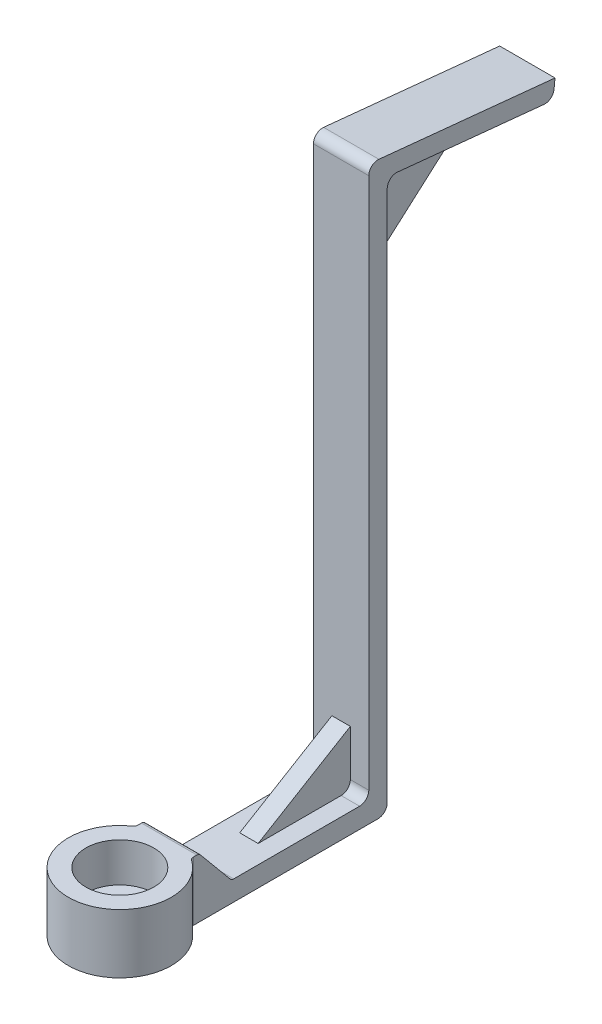
ISO-10303-21;
HEADER;
FILE_DESCRIPTION(('STEP AP214'),'2;1');
FILE_NAME('part.step','',(''),(''),'','','');
FILE_SCHEMA(('AUTOMOTIVE_DESIGN { 1 0 10303 214 1 1 1 1 }'));
ENDSEC;
DATA;
#1=APPLICATION_CONTEXT('core data for automotive mechanical design processes');
#2=APPLICATION_PROTOCOL_DEFINITION('international standard','automotive_design',2000,#1);
#3=PRODUCT_CONTEXT('',#1,'mechanical');
#4=PRODUCT('Part','Part','',(#3));
#5=PRODUCT_RELATED_PRODUCT_CATEGORY('part','',(#4));
#6=PRODUCT_DEFINITION_FORMATION('','',#4);
#7=PRODUCT_DEFINITION_CONTEXT('part definition',#1,'design');
#8=PRODUCT_DEFINITION('design','',#6,#7);
#9=PRODUCT_DEFINITION_SHAPE('','',#8);
#10=(LENGTH_UNIT() NAMED_UNIT(*) SI_UNIT(.MILLI.,.METRE.));
#11=(NAMED_UNIT(*) PLANE_ANGLE_UNIT() SI_UNIT($,.RADIAN.));
#12=(NAMED_UNIT(*) SI_UNIT($,.STERADIAN.) SOLID_ANGLE_UNIT());
#13=UNCERTAINTY_MEASURE_WITH_UNIT(LENGTH_MEASURE(1.E-05),#10,'distance_accuracy_value','');
#14=(GEOMETRIC_REPRESENTATION_CONTEXT(3) GLOBAL_UNCERTAINTY_ASSIGNED_CONTEXT((#13)) GLOBAL_UNIT_ASSIGNED_CONTEXT((#10,
#11,#12)) REPRESENTATION_CONTEXT('',''));
#15=CARTESIAN_POINT('',(0.,0.,0.));
#16=DIRECTION('',(0.,0.,1.));
#17=DIRECTION('',(1.,0.,0.));
#18=AXIS2_PLACEMENT_3D('',#15,#16,#17);
#19=CARTESIAN_POINT('',(0.,1.0922,0.));
#20=DIRECTION('',(0.,1.,0.));
#21=DIRECTION('',(0.,0.,1.));
#22=AXIS2_PLACEMENT_3D('',#19,#20,#21);
#23=PLANE('',#22);
#24=DIRECTION('',(0.,0.,1.));
#25=VECTOR('',#24,1.);
#26=CARTESIAN_POINT('',(-1.5,1.0922,-13.));
#27=LINE('',#26,#25);
#28=CARTESIAN_POINT('',(-1.5,1.0922,-11.5));
#29=VERTEX_POINT('',#28);
#30=CARTESIAN_POINT('',(-1.5,1.0922,-4.67448177129024));
#31=VERTEX_POINT('',#30);
#32=EDGE_CURVE('E351',#29,#31,#27,.T.);
#33=ORIENTED_EDGE('',*,*,#32,.T.);
#34=DIRECTION('',(-1.,0.,0.));
#35=VECTOR('',#34,1.);
#36=CARTESIAN_POINT('',(0.,1.0922,-4.67448177129024));
#37=LINE('',#36,#35);
#38=CARTESIAN_POINT('',(1.5,1.0922,-4.67448177129024));
#39=VERTEX_POINT('',#38);
#40=EDGE_CURVE('E471',#31,#39,#37,.F.);
#41=ORIENTED_EDGE('',*,*,#40,.T.);
#42=DIRECTION('',(0.,0.,-1.));
#43=VECTOR('',#42,1.);
#44=CARTESIAN_POINT('',(1.5,1.0922,-6.604));
#45=LINE('',#44,#43);
#46=CARTESIAN_POINT('',(1.5,1.0922,-11.5));
#47=VERTEX_POINT('',#46);
#48=EDGE_CURVE('E348',#39,#47,#45,.T.);
#49=ORIENTED_EDGE('',*,*,#48,.T.);
#50=DIRECTION('',(1.,0.,0.));
#51=VECTOR('',#50,1.);
#52=CARTESIAN_POINT('',(-1.5,1.0922,-11.5));
#53=LINE('',#52,#51);
#54=CARTESIAN_POINT('',(0.5,1.0922,-11.5));
#55=VERTEX_POINT('',#54);
#56=EDGE_CURVE('E425',#47,#55,#53,.F.);
#57=ORIENTED_EDGE('',*,*,#56,.T.);
#58=DIRECTION('',(0.,0.,-1.));
#59=VECTOR('',#58,1.);
#60=CARTESIAN_POINT('',(0.5,1.0922,0.));
#61=LINE('',#60,#59);
#62=CARTESIAN_POINT('',(0.5,1.0922,-7.));
#63=VERTEX_POINT('',#62);
#64=EDGE_CURVE('E294',#63,#55,#61,.T.);
#65=ORIENTED_EDGE('',*,*,#64,.F.);
#66=DIRECTION('',(1.,0.,0.));
#67=VECTOR('',#66,1.);
#68=CARTESIAN_POINT('',(0.,1.0922,-7.));
#69=LINE('',#68,#67);
#70=CARTESIAN_POINT('',(-0.5,1.0922,-7.));
#71=VERTEX_POINT('',#70);
#72=EDGE_CURVE('E297',#71,#63,#69,.T.);
#73=ORIENTED_EDGE('',*,*,#72,.F.);
#74=DIRECTION('',(0.,0.,-1.));
#75=VECTOR('',#74,1.);
#76=CARTESIAN_POINT('',(-0.5,1.0922,0.));
#77=LINE('',#76,#75);
#78=CARTESIAN_POINT('',(-0.5,1.0922,-11.5));
#79=VERTEX_POINT('',#78);
#80=EDGE_CURVE('E286',#71,#79,#77,.T.);
#81=ORIENTED_EDGE('',*,*,#80,.T.);
#82=EDGE_CURVE('E424',#79,#29,#53,.F.);
#83=ORIENTED_EDGE('',*,*,#82,.T.);
#84=EDGE_LOOP('',(#33,#41,#49,#57,#65,#73,#81,#83));
#85=FACE_BOUND('',#84,.T.);
#86=ADVANCED_FACE('F41',(#85),#23,.T.);
#87=CARTESIAN_POINT('',(1.5,29.347506218944,-13.5));
#88=DIRECTION('',(1.,0.,0.));
#89=DIRECTION('',(0.,1.,0.));
#90=AXIS2_PLACEMENT_3D('',#87,#88,#89);
#91=CYLINDRICAL_SURFACE('',#90,0.5);
#92=CARTESIAN_POINT('',(-0.5,29.347506218944,-13.5));
#93=DIRECTION('',(1.,0.,0.));
#94=DIRECTION('',(0.,0.,-1.));
#95=AXIS2_PLACEMENT_3D('',#92,#93,#94);
#96=CIRCLE('',#95,0.5);
#97=CARTESIAN_POINT('',(-0.5,29.347506218944,-13.));
#98=VERTEX_POINT('',#97);
#99=CARTESIAN_POINT('',(-0.5,29.8450248140489,-13.5497518595105));
#100=VERTEX_POINT('',#99);
#101=EDGE_CURVE('E225',#98,#100,#96,.F.);
#102=ORIENTED_EDGE('',*,*,#101,.F.);
#103=DIRECTION('',(1.,0.,0.));
#104=VECTOR('',#103,1.);
#105=CARTESIAN_POINT('',(1.5,29.347506218944,-13.));
#106=LINE('',#105,#104);
#107=CARTESIAN_POINT('',(-1.5,29.347506218944,-13.));
#108=VERTEX_POINT('',#107);
#109=EDGE_CURVE('E388',#108,#98,#106,.T.);
#110=ORIENTED_EDGE('',*,*,#109,.F.);
#111=CARTESIAN_POINT('',(-1.5,29.347506218944,-13.5));
#112=DIRECTION('',(1.,0.,0.));
#113=DIRECTION('',(0.,0.,-1.));
#114=AXIS2_PLACEMENT_3D('',#111,#112,#113);
#115=CIRCLE('',#114,0.5);
#116=CARTESIAN_POINT('',(-1.5,29.8450248140489,-13.5497518595105));
#117=VERTEX_POINT('',#116);
#118=EDGE_CURVE('E227',#117,#108,#115,.T.);
#119=ORIENTED_EDGE('',*,*,#118,.F.);
#120=DIRECTION('',(1.,0.,0.));
#121=VECTOR('',#120,1.);
#122=CARTESIAN_POINT('',(-11.796598977077,29.8450248140489,-13.5497518595105));
#123=LINE('',#122,#121);
#124=EDGE_CURVE('E220',#100,#117,#123,.F.);
#125=ORIENTED_EDGE('',*,*,#124,.F.);
#126=EDGE_LOOP('',(#102,#110,#119,#125));
#127=FACE_BOUND('',#126,.T.);
#128=ADVANCED_FACE('F222',(#127),#91,.F.);
#129=CARTESIAN_POINT('',(1.5,1.5922,-11.5));
#130=DIRECTION('',(-1.,0.,0.));
#131=DIRECTION('',(0.,0.,1.));
#132=AXIS2_PLACEMENT_3D('',#129,#130,#131);
#133=CYLINDRICAL_SURFACE('',#132,0.5);
#134=CARTESIAN_POINT('',(-0.5,1.5922,-11.5));
#135=DIRECTION('',(1.,0.,0.));
#136=DIRECTION('',(0.,0.,-1.));
#137=AXIS2_PLACEMENT_3D('',#134,#135,#136);
#138=CIRCLE('',#137,0.5);
#139=CARTESIAN_POINT('',(-0.5,1.5922,-12.));
#140=VERTEX_POINT('',#139);
#141=EDGE_CURVE('E452',#140,#79,#138,.F.);
#142=ORIENTED_EDGE('',*,*,#141,.F.);
#143=DIRECTION('',(1.,0.,0.));
#144=VECTOR('',#143,1.);
#145=CARTESIAN_POINT('',(1.5,1.5922,-12.));
#146=LINE('',#145,#144);
#147=CARTESIAN_POINT('',(-1.5,1.5922,-12.));
#148=VERTEX_POINT('',#147);
#149=EDGE_CURVE('E420',#148,#140,#146,.T.);
#150=ORIENTED_EDGE('',*,*,#149,.F.);
#151=CARTESIAN_POINT('',(-1.5,1.5922,-11.5));
#152=DIRECTION('',(1.,0.,0.));
#153=DIRECTION('',(0.,0.,-1.));
#154=AXIS2_PLACEMENT_3D('',#151,#152,#153);
#155=CIRCLE('',#154,0.5);
#156=EDGE_CURVE('E444',#29,#148,#155,.T.);
#157=ORIENTED_EDGE('',*,*,#156,.F.);
#158=ORIENTED_EDGE('',*,*,#82,.F.);
#159=EDGE_LOOP('',(#142,#150,#157,#158));
#160=FACE_BOUND('',#159,.T.);
#161=ADVANCED_FACE('F566',(#160),#133,.F.);
#162=CARTESIAN_POINT('',(0.,1.0922,0.));
#163=DIRECTION('',(0.,1.,0.));
#164=DIRECTION('',(0.,0.,1.));
#165=AXIS2_PLACEMENT_3D('',#162,#163,#164);
#166=CYLINDRICAL_SURFACE('',#165,0.899999999999999);
#167=CARTESIAN_POINT('',(0.,1.0922,0.));
#168=DIRECTION('',(0.,1.,0.));
#169=DIRECTION('',(0.,0.,1.));
#170=AXIS2_PLACEMENT_3D('',#167,#168,#169);
#171=CIRCLE('',#170,0.899999999999999);
#172=CARTESIAN_POINT('',(0.,1.0922,0.899999999999999));
#173=VERTEX_POINT('',#172);
#174=EDGE_CURVE('E343',#173,#173,#171,.T.);
#175=ORIENTED_EDGE('',*,*,#174,.T.);
#176=EDGE_LOOP('',(#175));
#177=FACE_BOUND('',#176,.T.);
#178=CARTESIAN_POINT('',(0.,0.127,0.));
#179=DIRECTION('',(0.,-1.,0.));
#180=DIRECTION('',(0.,0.,-1.));
#181=AXIS2_PLACEMENT_3D('',#178,#179,#180);
#182=CIRCLE('',#181,0.899999999999999);
#183=CARTESIAN_POINT('',(0.,0.127,-0.899999999999999));
#184=VERTEX_POINT('',#183);
#185=EDGE_CURVE('E339',#184,#184,#182,.F.);
#186=ORIENTED_EDGE('',*,*,#185,.F.);
#187=EDGE_LOOP('',(#186));
#188=FACE_BOUND('',#187,.T.);
#189=ADVANCED_FACE('F653',(#177,#188),#166,.F.);
#190=CARTESIAN_POINT('',(0.,3.2131,0.));
#191=DIRECTION('',(0.,1.,0.));
#192=DIRECTION('',(0.,0.,1.));
#193=AXIS2_PLACEMENT_3D('',#190,#191,#192);
#194=PLANE('',#193);
#195=DIRECTION('',(0.,0.,1.));
#196=VECTOR('',#195,1.);
#197=CARTESIAN_POINT('',(1.5,3.2131,-2.35720936702704));
#198=LINE('',#197,#196);
#199=CARTESIAN_POINT('',(1.5,3.2131,-2.67672759573679));
#200=VERTEX_POINT('',#199);
#201=CARTESIAN_POINT('',(1.5,3.2131,-2.49066978943416));
#202=VERTEX_POINT('',#201);
#203=EDGE_CURVE('E596',#200,#202,#198,.T.);
#204=ORIENTED_EDGE('',*,*,#203,.F.);
#205=DIRECTION('',(-1.,0.,0.));
#206=VECTOR('',#205,1.);
#207=CARTESIAN_POINT('',(-1.5,3.2131,-2.67672759573679));
#208=LINE('',#207,#206);
#209=CARTESIAN_POINT('',(-1.5,3.2131,-2.67672759573679));
#210=VERTEX_POINT('',#209);
#211=EDGE_CURVE('E474',#200,#210,#208,.T.);
#212=ORIENTED_EDGE('',*,*,#211,.T.);
#213=DIRECTION('',(0.,0.,1.));
#214=VECTOR('',#213,1.);
#215=CARTESIAN_POINT('',(-1.5,3.2131,-2.35720936702704));
#216=LINE('',#215,#214);
#217=CARTESIAN_POINT('',(-1.5,3.2131,-2.49066978943416));
#218=VERTEX_POINT('',#217);
#219=EDGE_CURVE('E597',#210,#218,#216,.T.);
#220=ORIENTED_EDGE('',*,*,#219,.T.);
#221=CARTESIAN_POINT('',(-1.75,3.2131,-2.49066978943416));
#222=DIRECTION('',(0.,1.,0.));
#223=DIRECTION('',(0.,0.,1.));
#224=AXIS2_PLACEMENT_3D('',#221,#222,#223);
#225=CIRCLE('',#224,0.25);
#226=CARTESIAN_POINT('',(-1.60627463863338,3.2131,-2.28611412341624));
#227=VERTEX_POINT('',#226);
#228=EDGE_CURVE('E505',#218,#227,#225,.F.);
#229=ORIENTED_EDGE('',*,*,#228,.T.);
#230=CARTESIAN_POINT('',(0.,3.2131,0.));
#231=DIRECTION('',(0.,1.,0.));
#232=DIRECTION('',(0.,0.,1.));
#233=AXIS2_PLACEMENT_3D('',#230,#231,#232);
#234=CIRCLE('',#233,2.794);
#235=CARTESIAN_POINT('',(1.60627463863338,3.2131,-2.28611412341624));
#236=VERTEX_POINT('',#235);
#237=EDGE_CURVE('E374',#227,#236,#234,.T.);
#238=ORIENTED_EDGE('',*,*,#237,.T.);
#239=CARTESIAN_POINT('',(1.75,3.2131,-2.49066978943416));
#240=DIRECTION('',(0.,1.,0.));
#241=DIRECTION('',(0.,0.,1.));
#242=AXIS2_PLACEMENT_3D('',#239,#240,#241);
#243=CIRCLE('',#242,0.25);
#244=EDGE_CURVE('E11',#236,#202,#243,.F.);
#245=ORIENTED_EDGE('',*,*,#244,.T.);
#246=EDGE_LOOP('',(#204,#212,#220,#229,#238,#245));
#247=FACE_BOUND('',#246,.T.);
#248=CARTESIAN_POINT('',(0.,3.2131,0.));
#249=DIRECTION('',(0.,1.,0.));
#250=DIRECTION('',(0.,0.,1.));
#251=AXIS2_PLACEMENT_3D('',#248,#249,#250);
#252=CIRCLE('',#251,1.8415);
#253=CARTESIAN_POINT('',(0.,3.2131,1.8415));
#254=VERTEX_POINT('',#253);
#255=EDGE_CURVE('E369',#254,#254,#252,.T.);
#256=ORIENTED_EDGE('',*,*,#255,.F.);
#257=EDGE_LOOP('',(#256));
#258=FACE_BOUND('',#257,.T.);
#259=ADVANCED_FACE('F650',(#247,#258),#194,.T.);
#260=CARTESIAN_POINT('',(0.,0.,0.));
#261=DIRECTION('',(0.,1.,0.));
#262=DIRECTION('',(0.,0.,1.));
#263=AXIS2_PLACEMENT_3D('',#260,#261,#262);
#264=PLANE('',#263);
#265=DIRECTION('',(-1.,0.,0.));
#266=VECTOR('',#265,1.);
#267=CARTESIAN_POINT('',(0.,0.,-12.5));
#268=LINE('',#267,#266);
#269=CARTESIAN_POINT('',(-1.5,0.,-12.5));
#270=VERTEX_POINT('',#269);
#271=CARTESIAN_POINT('',(1.5,0.,-12.5));
#272=VERTEX_POINT('',#271);
#273=EDGE_CURVE('E403',#270,#272,#268,.F.);
#274=ORIENTED_EDGE('',*,*,#273,.T.);
#275=DIRECTION('',(0.,0.,-1.));
#276=VECTOR('',#275,1.);
#277=CARTESIAN_POINT('',(1.5,0.,-6.604));
#278=LINE('',#277,#276);
#279=CARTESIAN_POINT('',(1.5,0.,-2.49066978943416));
#280=VERTEX_POINT('',#279);
#281=EDGE_CURVE('E347',#280,#272,#278,.T.);
#282=ORIENTED_EDGE('',*,*,#281,.F.);
#283=CARTESIAN_POINT('',(1.75,0.,-2.49066978943416));
#284=DIRECTION('',(0.,1.,0.));
#285=DIRECTION('',(0.,0.,1.));
#286=AXIS2_PLACEMENT_3D('',#283,#284,#285);
#287=CIRCLE('',#286,0.25);
#288=CARTESIAN_POINT('',(1.60627463863338,0.,-2.28611412341624));
#289=VERTEX_POINT('',#288);
#290=EDGE_CURVE('E50',#280,#289,#287,.T.);
#291=ORIENTED_EDGE('',*,*,#290,.T.);
#292=CARTESIAN_POINT('',(0.,0.,0.));
#293=DIRECTION('',(0.,1.,0.));
#294=DIRECTION('',(0.,0.,1.));
#295=AXIS2_PLACEMENT_3D('',#292,#293,#294);
#296=CIRCLE('',#295,2.794);
#297=CARTESIAN_POINT('',(-1.60627463863338,0.,-2.28611412341624));
#298=VERTEX_POINT('',#297);
#299=EDGE_CURVE('E373',#298,#289,#296,.T.);
#300=ORIENTED_EDGE('',*,*,#299,.F.);
#301=CARTESIAN_POINT('',(-1.75,0.,-2.49066978943416));
#302=DIRECTION('',(0.,1.,0.));
#303=DIRECTION('',(0.,0.,1.));
#304=AXIS2_PLACEMENT_3D('',#301,#302,#303);
#305=CIRCLE('',#304,0.25);
#306=CARTESIAN_POINT('',(-1.5,0.,-2.49066978943416));
#307=VERTEX_POINT('',#306);
#308=EDGE_CURVE('E64',#298,#307,#305,.T.);
#309=ORIENTED_EDGE('',*,*,#308,.T.);
#310=DIRECTION('',(0.,0.,1.));
#311=VECTOR('',#310,1.);
#312=CARTESIAN_POINT('',(-1.5,0.,-6.604));
#313=LINE('',#312,#311);
#314=EDGE_CURVE('E352',#270,#307,#313,.T.);
#315=ORIENTED_EDGE('',*,*,#314,.F.);
#316=EDGE_LOOP('',(#274,#282,#291,#300,#309,#315));
#317=FACE_BOUND('',#316,.T.);
#318=CARTESIAN_POINT('',(0.,0.,0.));
#319=DIRECTION('',(0.,-1.,0.));
#320=DIRECTION('',(0.,0.,-1.));
#321=AXIS2_PLACEMENT_3D('',#318,#319,#320);
#322=CIRCLE('',#321,1.651);
#323=CARTESIAN_POINT('',(0.,0.,-1.651));
#324=VERTEX_POINT('',#323);
#325=EDGE_CURVE('E331',#324,#324,#322,.T.);
#326=ORIENTED_EDGE('',*,*,#325,.F.);
#327=EDGE_LOOP('',(#326));
#328=FACE_BOUND('',#327,.T.);
#329=ADVANCED_FACE('F652',(#317,#328),#264,.F.);
#330=CARTESIAN_POINT('',(0.,3.2131,0.));
#331=DIRECTION('',(0.,-1.,0.));
#332=DIRECTION('',(0.,0.,-1.));
#333=AXIS2_PLACEMENT_3D('',#330,#331,#332);
#334=CYLINDRICAL_SURFACE('',#333,2.794);
#335=ORIENTED_EDGE('',*,*,#237,.F.);
#336=DIRECTION('',(0.,-1.,0.));
#337=VECTOR('',#336,1.);
#338=CARTESIAN_POINT('',(-1.60627463863338,3.2131,-2.28611412341624));
#339=LINE('',#338,#337);
#340=EDGE_CURVE('E494',#227,#298,#339,.T.);
#341=ORIENTED_EDGE('',*,*,#340,.T.);
#342=ORIENTED_EDGE('',*,*,#299,.T.);
#343=DIRECTION('',(0.,-1.,0.));
#344=VECTOR('',#343,1.);
#345=CARTESIAN_POINT('',(1.60627463863338,3.2131,-2.28611412341624));
#346=LINE('',#345,#344);
#347=EDGE_CURVE('E491',#289,#236,#346,.F.);
#348=ORIENTED_EDGE('',*,*,#347,.T.);
#349=EDGE_LOOP('',(#335,#341,#342,#348));
#350=FACE_BOUND('',#349,.T.);
#351=ADVANCED_FACE('F641',(#350),#334,.T.);
#352=CARTESIAN_POINT('',(0.,3.2131,0.));
#353=DIRECTION('',(0.,-1.,0.));
#354=DIRECTION('',(0.,0.,-1.));
#355=AXIS2_PLACEMENT_3D('',#352,#353,#354);
#356=CYLINDRICAL_SURFACE('',#355,1.8415);
#357=CARTESIAN_POINT('',(0.,1.0922,0.));
#358=DIRECTION('',(0.,1.,0.));
#359=DIRECTION('',(0.,0.,1.));
#360=AXIS2_PLACEMENT_3D('',#357,#358,#359);
#361=CIRCLE('',#360,1.8415);
#362=CARTESIAN_POINT('',(0.,1.0922,1.8415));
#363=VERTEX_POINT('',#362);
#364=EDGE_CURVE('E378',#363,#363,#361,.T.);
#365=ORIENTED_EDGE('',*,*,#364,.F.);
#366=EDGE_LOOP('',(#365));
#367=FACE_BOUND('',#366,.T.);
#368=ORIENTED_EDGE('',*,*,#255,.T.);
#369=EDGE_LOOP('',(#368));
#370=FACE_BOUND('',#369,.T.);
#371=ADVANCED_FACE('F634',(#367,#370),#356,.F.);
#372=ORIENTED_EDGE('',*,*,#174,.F.);
#373=EDGE_LOOP('',(#372));
#374=FACE_BOUND('',#373,.T.);
#375=ORIENTED_EDGE('',*,*,#364,.T.);
#376=EDGE_LOOP('',(#375));
#377=FACE_BOUND('',#376,.T.);
#378=ADVANCED_FACE('F626',(#374,#377),#23,.T.);
#379=CARTESIAN_POINT('',(1.5,1.0922,-6.604));
#380=DIRECTION('',(-1.,0.,0.));
#381=DIRECTION('',(0.,0.,1.));
#382=AXIS2_PLACEMENT_3D('',#379,#380,#381);
#383=PLANE('',#382);
#384=DIRECTION('',(0.,0.76897096515281,0.63928370443173));
#385=VECTOR('',#384,1.);
#386=CARTESIAN_POINT('',(1.5,3.2131,-2.794));
#387=LINE('',#386,#385);
#388=CARTESIAN_POINT('',(1.5,1.18237907389207,-4.48223903000204));
#389=VERTEX_POINT('',#388);
#390=CARTESIAN_POINT('',(1.5,3.12292092610793,-2.868970337025));
#391=VERTEX_POINT('',#390);
#392=EDGE_CURVE('E594',#389,#391,#387,.T.);
#393=ORIENTED_EDGE('',*,*,#392,.T.);
#394=CARTESIAN_POINT('',(1.5,2.9631,-2.67672759573679));
#395=DIRECTION('',(-1.,0.,0.));
#396=DIRECTION('',(0.,0.,1.));
#397=AXIS2_PLACEMENT_3D('',#394,#395,#396);
#398=CIRCLE('',#397,0.25);
#399=EDGE_CURVE('E488',#391,#200,#398,.F.);
#400=ORIENTED_EDGE('',*,*,#399,.T.);
#401=ORIENTED_EDGE('',*,*,#203,.T.);
#402=DIRECTION('',(0.,1.,0.));
#403=VECTOR('',#402,1.);
#404=CARTESIAN_POINT('',(1.5,0.,-2.49066978943416));
#405=LINE('',#404,#403);
#406=EDGE_CURVE('E484',#202,#280,#405,.F.);
#407=ORIENTED_EDGE('',*,*,#406,.T.);
#408=ORIENTED_EDGE('',*,*,#281,.T.);
#409=CARTESIAN_POINT('',(1.5,0.5,-12.5));
#410=DIRECTION('',(-1.,0.,0.));
#411=DIRECTION('',(0.,0.,1.));
#412=AXIS2_PLACEMENT_3D('',#409,#410,#411);
#413=CIRCLE('',#412,0.5);
#414=CARTESIAN_POINT('',(1.5,0.5,-13.));
#415=VERTEX_POINT('',#414);
#416=EDGE_CURVE('E413',#272,#415,#413,.F.);
#417=ORIENTED_EDGE('',*,*,#416,.T.);
#418=DIRECTION('',(0.,-1.,0.));
#419=VECTOR('',#418,1.);
#420=CARTESIAN_POINT('',(1.5,1.0922,-13.));
#421=LINE('',#420,#419);
#422=CARTESIAN_POINT('',(1.5,29.347506218944,-13.));
#423=VERTEX_POINT('',#422);
#424=EDGE_CURVE('E365',#423,#415,#421,.T.);
#425=ORIENTED_EDGE('',*,*,#424,.F.);
#426=CARTESIAN_POINT('',(1.5,29.347506218944,-13.5));
#427=DIRECTION('',(-1.,0.,0.));
#428=DIRECTION('',(0.,0.,1.));
#429=AXIS2_PLACEMENT_3D('',#426,#427,#428);
#430=CIRCLE('',#429,0.5);
#431=CARTESIAN_POINT('',(1.5,29.8450248140489,-13.5497518595105));
#432=VERTEX_POINT('',#431);
#433=EDGE_CURVE('E447',#423,#432,#430,.T.);
#434=ORIENTED_EDGE('',*,*,#433,.T.);
#435=DIRECTION('',(0.,-0.099503719020999,-0.995037190209989));
#436=VECTOR('',#435,1.);
#437=CARTESIAN_POINT('',(1.5,29.,-22.));
#438=LINE('',#437,#436);
#439=CARTESIAN_POINT('',(1.5,29.0497518595105,-21.502481404895));
#440=VERTEX_POINT('',#439);
#441=EDGE_CURVE('E301',#432,#440,#438,.T.);
#442=ORIENTED_EDGE('',*,*,#441,.T.);
#443=CARTESIAN_POINT('',(1.5,29.5472704546155,-21.5522332644055));
#444=DIRECTION('',(-1.,0.,0.));
#445=DIRECTION('',(0.,0.,1.));
#446=AXIS2_PLACEMENT_3D('',#443,#444,#445);
#447=CIRCLE('',#446,0.5);
#448=CARTESIAN_POINT('',(1.5,29.497518595105,-22.0497518595105));
#449=VERTEX_POINT('',#448);
#450=EDGE_CURVE('E410',#440,#449,#447,.F.);
#451=ORIENTED_EDGE('',*,*,#450,.T.);
#452=DIRECTION('',(0.,0.995037190209989,-0.0995037190209996));
#453=VECTOR('',#452,1.);
#454=CARTESIAN_POINT('',(1.5,29.,-22.));
#455=LINE('',#454,#453);
#456=CARTESIAN_POINT('',(1.5,29.99503719021,-22.099503719021));
#457=VERTEX_POINT('',#456);
#458=EDGE_CURVE('E314',#449,#457,#455,.T.);
#459=ORIENTED_EDGE('',*,*,#458,.T.);
#460=DIRECTION('',(0.,0.0995037190209984,0.995037190209989));
#461=VECTOR('',#460,1.);
#462=CARTESIAN_POINT('',(1.5,29.99503719021,-22.099503719021));
#463=LINE('',#462,#461);
#464=CARTESIAN_POINT('',(1.5,30.950012376161,-12.5497518595105));
#465=VERTEX_POINT('',#464);
#466=EDGE_CURVE('E317',#457,#465,#463,.T.);
#467=ORIENTED_EDGE('',*,*,#466,.T.);
#468=CARTESIAN_POINT('',(1.5,30.452493781056,-12.5));
#469=DIRECTION('',(-1.,0.,0.));
#470=DIRECTION('',(0.,0.,1.));
#471=AXIS2_PLACEMENT_3D('',#468,#469,#470);
#472=CIRCLE('',#471,0.5);
#473=CARTESIAN_POINT('',(1.5,30.452493781056,-12.));
#474=VERTEX_POINT('',#473);
#475=EDGE_CURVE('E407',#465,#474,#472,.F.);
#476=ORIENTED_EDGE('',*,*,#475,.T.);
#477=DIRECTION('',(0.,-1.,0.));
#478=VECTOR('',#477,1.);
#479=CARTESIAN_POINT('',(1.5,30.,-12.));
#480=LINE('',#479,#478);
#481=CARTESIAN_POINT('',(1.5,1.5922,-12.));
#482=VERTEX_POINT('',#481);
#483=EDGE_CURVE('E326',#474,#482,#480,.T.);
#484=ORIENTED_EDGE('',*,*,#483,.T.);
#485=CARTESIAN_POINT('',(1.5,1.5922,-11.5));
#486=DIRECTION('',(-1.,0.,0.));
#487=DIRECTION('',(0.,0.,1.));
#488=AXIS2_PLACEMENT_3D('',#485,#486,#487);
#489=CIRCLE('',#488,0.5);
#490=EDGE_CURVE('E440',#482,#47,#489,.T.);
#491=ORIENTED_EDGE('',*,*,#490,.T.);
#492=ORIENTED_EDGE('',*,*,#48,.F.);
#493=CARTESIAN_POINT('',(1.5,1.3422,-4.67448177129024));
#494=DIRECTION('',(-1.,0.,0.));
#495=DIRECTION('',(0.,0.,1.));
#496=AXIS2_PLACEMENT_3D('',#493,#494,#495);
#497=CIRCLE('',#496,0.25);
#498=EDGE_CURVE('E500',#39,#389,#497,.T.);
#499=ORIENTED_EDGE('',*,*,#498,.T.);
#500=EDGE_LOOP('',(#393,#400,#401,#407,#408,#417,#425,#434,#442,#451,#459,#467,#476,#484,#491,
#492,#499));
#501=FACE_BOUND('',#500,.T.);
#502=ADVANCED_FACE('F524',(#501),#383,.F.);
#503=CARTESIAN_POINT('',(1.5,1.0922,-13.));
#504=DIRECTION('',(0.,0.,1.));
#505=DIRECTION('',(1.,0.,0.));
#506=AXIS2_PLACEMENT_3D('',#503,#504,#505);
#507=PLANE('',#506);
#508=DIRECTION('',(-1.,0.,0.));
#509=VECTOR('',#508,1.);
#510=CARTESIAN_POINT('',(1.5,24.99503719021,-13.));
#511=LINE('',#510,#509);
#512=CARTESIAN_POINT('',(-0.5,24.99503719021,-13.));
#513=VERTEX_POINT('',#512);
#514=CARTESIAN_POINT('',(0.5,24.99503719021,-13.));
#515=VERTEX_POINT('',#514);
#516=EDGE_CURVE('E272',#513,#515,#511,.F.);
#517=ORIENTED_EDGE('',*,*,#516,.T.);
#518=DIRECTION('',(0.,1.,0.));
#519=VECTOR('',#518,1.);
#520=CARTESIAN_POINT('',(0.5,1.0922,-13.));
#521=LINE('',#520,#519);
#522=CARTESIAN_POINT('',(0.5,29.347506218944,-13.));
#523=VERTEX_POINT('',#522);
#524=EDGE_CURVE('E266',#515,#523,#521,.T.);
#525=ORIENTED_EDGE('',*,*,#524,.T.);
#526=EDGE_CURVE('E384',#523,#423,#106,.T.);
#527=ORIENTED_EDGE('',*,*,#526,.T.);
#528=ORIENTED_EDGE('',*,*,#424,.T.);
#529=DIRECTION('',(-1.,0.,0.));
#530=VECTOR('',#529,1.);
#531=CARTESIAN_POINT('',(1.5,0.5,-13.));
#532=LINE('',#531,#530);
#533=CARTESIAN_POINT('',(-1.5,0.5,-13.));
#534=VERTEX_POINT('',#533);
#535=EDGE_CURVE('E391',#415,#534,#532,.T.);
#536=ORIENTED_EDGE('',*,*,#535,.T.);
#537=DIRECTION('',(0.,-1.,0.));
#538=VECTOR('',#537,1.);
#539=CARTESIAN_POINT('',(-1.5,1.0922,-13.));
#540=LINE('',#539,#538);
#541=EDGE_CURVE('E356',#108,#534,#540,.T.);
#542=ORIENTED_EDGE('',*,*,#541,.F.);
#543=ORIENTED_EDGE('',*,*,#109,.T.);
#544=DIRECTION('',(0.,1.,0.));
#545=VECTOR('',#544,1.);
#546=CARTESIAN_POINT('',(-0.5,1.0922,-13.));
#547=LINE('',#546,#545);
#548=EDGE_CURVE('E244',#513,#98,#547,.T.);
#549=ORIENTED_EDGE('',*,*,#548,.F.);
#550=EDGE_LOOP('',(#517,#525,#527,#528,#536,#542,#543,#549));
#551=FACE_BOUND('',#550,.T.);
#552=ADVANCED_FACE('F514',(#551),#507,.F.);
#553=CARTESIAN_POINT('',(-1.5,1.0922,-6.604));
#554=DIRECTION('',(1.,0.,0.));
#555=DIRECTION('',(0.,0.,-1.));
#556=AXIS2_PLACEMENT_3D('',#553,#554,#555);
#557=PLANE('',#556);
#558=ORIENTED_EDGE('',*,*,#219,.F.);
#559=CARTESIAN_POINT('',(-1.5,2.9631,-2.67672759573679));
#560=DIRECTION('',(1.,0.,0.));
#561=DIRECTION('',(0.,0.,-1.));
#562=AXIS2_PLACEMENT_3D('',#559,#560,#561);
#563=CIRCLE('',#562,0.25);
#564=CARTESIAN_POINT('',(-1.5,3.12292092610793,-2.868970337025));
#565=VERTEX_POINT('',#564);
#566=EDGE_CURVE('E481',#210,#565,#563,.F.);
#567=ORIENTED_EDGE('',*,*,#566,.T.);
#568=DIRECTION('',(0.,0.76897096515281,0.63928370443173));
#569=VECTOR('',#568,1.);
#570=CARTESIAN_POINT('',(-1.5,3.2131,-2.794));
#571=LINE('',#570,#569);
#572=CARTESIAN_POINT('',(-1.5,1.18237907389207,-4.48223903000204));
#573=VERTEX_POINT('',#572);
#574=EDGE_CURVE('E592',#573,#565,#571,.T.);
#575=ORIENTED_EDGE('',*,*,#574,.F.);
#576=CARTESIAN_POINT('',(-1.5,1.3422,-4.67448177129024));
#577=DIRECTION('',(1.,0.,0.));
#578=DIRECTION('',(0.,0.,-1.));
#579=AXIS2_PLACEMENT_3D('',#576,#577,#578);
#580=CIRCLE('',#579,0.25);
#581=EDGE_CURVE('E497',#573,#31,#580,.T.);
#582=ORIENTED_EDGE('',*,*,#581,.T.);
#583=ORIENTED_EDGE('',*,*,#32,.F.);
#584=ORIENTED_EDGE('',*,*,#156,.T.);
#585=DIRECTION('',(0.,-1.,0.));
#586=VECTOR('',#585,1.);
#587=CARTESIAN_POINT('',(-1.5,30.,-12.));
#588=LINE('',#587,#586);
#589=CARTESIAN_POINT('',(-1.5,30.452493781056,-12.));
#590=VERTEX_POINT('',#589);
#591=EDGE_CURVE('E327',#590,#148,#588,.T.);
#592=ORIENTED_EDGE('',*,*,#591,.F.);
#593=CARTESIAN_POINT('',(-1.5,30.452493781056,-12.5));
#594=DIRECTION('',(1.,0.,0.));
#595=DIRECTION('',(0.,0.,-1.));
#596=AXIS2_PLACEMENT_3D('',#593,#594,#595);
#597=CIRCLE('',#596,0.5);
#598=CARTESIAN_POINT('',(-1.5,30.950012376161,-12.5497518595105));
#599=VERTEX_POINT('',#598);
#600=EDGE_CURVE('E394',#590,#599,#597,.F.);
#601=ORIENTED_EDGE('',*,*,#600,.T.);
#602=DIRECTION('',(0.,-0.0995037190209985,-0.995037190209989));
#603=VECTOR('',#602,1.);
#604=CARTESIAN_POINT('',(-1.5,29.99503719021,-22.099503719021));
#605=LINE('',#604,#603);
#606=CARTESIAN_POINT('',(-1.5,29.99503719021,-22.099503719021));
#607=VERTEX_POINT('',#606);
#608=EDGE_CURVE('E306',#599,#607,#605,.T.);
#609=ORIENTED_EDGE('',*,*,#608,.T.);
#610=DIRECTION('',(0.,-0.995037190209989,0.0995037190209996));
#611=VECTOR('',#610,1.);
#612=CARTESIAN_POINT('',(-1.5,29.,-22.));
#613=LINE('',#612,#611);
#614=CARTESIAN_POINT('',(-1.5,29.497518595105,-22.0497518595105));
#615=VERTEX_POINT('',#614);
#616=EDGE_CURVE('E302',#607,#615,#613,.T.);
#617=ORIENTED_EDGE('',*,*,#616,.T.);
#618=CARTESIAN_POINT('',(-1.5,29.5472704546155,-21.5522332644055));
#619=DIRECTION('',(1.,0.,0.));
#620=DIRECTION('',(0.,0.,-1.));
#621=AXIS2_PLACEMENT_3D('',#618,#619,#620);
#622=CIRCLE('',#621,0.5);
#623=CARTESIAN_POINT('',(-1.5,29.0497518595105,-21.502481404895));
#624=VERTEX_POINT('',#623);
#625=EDGE_CURVE('E397',#615,#624,#622,.F.);
#626=ORIENTED_EDGE('',*,*,#625,.T.);
#627=DIRECTION('',(0.,0.099503719020999,0.995037190209989));
#628=VECTOR('',#627,1.);
#629=CARTESIAN_POINT('',(-1.5,29.,-22.));
#630=LINE('',#629,#628);
#631=EDGE_CURVE('E310',#624,#117,#630,.T.);
#632=ORIENTED_EDGE('',*,*,#631,.T.);
#633=ORIENTED_EDGE('',*,*,#118,.T.);
#634=ORIENTED_EDGE('',*,*,#541,.T.);
#635=CARTESIAN_POINT('',(-1.5,0.5,-12.5));
#636=DIRECTION('',(1.,0.,0.));
#637=DIRECTION('',(0.,0.,-1.));
#638=AXIS2_PLACEMENT_3D('',#635,#636,#637);
#639=CIRCLE('',#638,0.5);
#640=EDGE_CURVE('E400',#534,#270,#639,.F.);
#641=ORIENTED_EDGE('',*,*,#640,.T.);
#642=ORIENTED_EDGE('',*,*,#314,.T.);
#643=DIRECTION('',(0.,1.,0.));
#644=VECTOR('',#643,1.);
#645=CARTESIAN_POINT('',(-1.5,3.2131,-2.49066978943416));
#646=LINE('',#645,#644);
#647=EDGE_CURVE('E478',#307,#218,#646,.T.);
#648=ORIENTED_EDGE('',*,*,#647,.T.);
#649=EDGE_LOOP('',(#558,#567,#575,#582,#583,#584,#592,#601,#609,#617,#626,#632,#633,#634,#641,
#642,#648));
#650=FACE_BOUND('',#649,.T.);
#651=ADVANCED_FACE('F533',(#650),#557,.F.);
#652=CARTESIAN_POINT('',(0.,0.127,0.));
#653=DIRECTION('',(0.,-1.,0.));
#654=DIRECTION('',(0.,0.,-1.));
#655=AXIS2_PLACEMENT_3D('',#652,#653,#654);
#656=PLANE('',#655);
#657=CARTESIAN_POINT('',(0.,0.127,0.));
#658=DIRECTION('',(0.,-1.,0.));
#659=DIRECTION('',(0.,0.,-1.));
#660=AXIS2_PLACEMENT_3D('',#657,#658,#659);
#661=CIRCLE('',#660,1.651);
#662=CARTESIAN_POINT('',(0.,0.127,-1.651));
#663=VERTEX_POINT('',#662);
#664=EDGE_CURVE('E335',#663,#663,#661,.T.);
#665=ORIENTED_EDGE('',*,*,#664,.T.);
#666=EDGE_LOOP('',(#665));
#667=FACE_BOUND('',#666,.T.);
#668=ORIENTED_EDGE('',*,*,#185,.T.);
#669=EDGE_LOOP('',(#668));
#670=FACE_BOUND('',#669,.T.);
#671=ADVANCED_FACE('F698',(#667,#670),#656,.T.);
#672=CARTESIAN_POINT('',(0.,0.127,0.));
#673=DIRECTION('',(0.,-1.,0.));
#674=DIRECTION('',(0.,0.,-1.));
#675=AXIS2_PLACEMENT_3D('',#672,#673,#674);
#676=CYLINDRICAL_SURFACE('',#675,1.651);
#677=ORIENTED_EDGE('',*,*,#664,.F.);
#678=EDGE_LOOP('',(#677));
#679=FACE_BOUND('',#678,.T.);
#680=ORIENTED_EDGE('',*,*,#325,.T.);
#681=EDGE_LOOP('',(#680));
#682=FACE_BOUND('',#681,.T.);
#683=ADVANCED_FACE('F696',(#679,#682),#676,.F.);
#684=CARTESIAN_POINT('',(1.5,30.,-12.));
#685=DIRECTION('',(0.,0.,1.));
#686=DIRECTION('',(1.,0.,0.));
#687=AXIS2_PLACEMENT_3D('',#684,#685,#686);
#688=PLANE('',#687);
#689=DIRECTION('',(1.,0.,0.));
#690=VECTOR('',#689,1.);
#691=CARTESIAN_POINT('',(1.5,30.452493781056,-12.));
#692=LINE('',#691,#690);
#693=EDGE_CURVE('E416',#474,#590,#692,.F.);
#694=ORIENTED_EDGE('',*,*,#693,.T.);
#695=ORIENTED_EDGE('',*,*,#591,.T.);
#696=ORIENTED_EDGE('',*,*,#149,.T.);
#697=DIRECTION('',(0.,1.,0.));
#698=VECTOR('',#697,1.);
#699=CARTESIAN_POINT('',(-0.5,30.,-12.));
#700=LINE('',#699,#698);
#701=CARTESIAN_POINT('',(-0.5,4.0922,-12.));
#702=VERTEX_POINT('',#701);
#703=EDGE_CURVE('E280',#140,#702,#700,.T.);
#704=ORIENTED_EDGE('',*,*,#703,.T.);
#705=DIRECTION('',(-1.,0.,0.));
#706=VECTOR('',#705,1.);
#707=CARTESIAN_POINT('',(1.5,4.0922,-12.));
#708=LINE('',#707,#706);
#709=CARTESIAN_POINT('',(0.5,4.0922,-12.));
#710=VERTEX_POINT('',#709);
#711=EDGE_CURVE('E460',#710,#702,#708,.T.);
#712=ORIENTED_EDGE('',*,*,#711,.F.);
#713=DIRECTION('',(0.,1.,0.));
#714=VECTOR('',#713,1.);
#715=CARTESIAN_POINT('',(0.5,30.,-12.));
#716=LINE('',#715,#714);
#717=CARTESIAN_POINT('',(0.5,1.5922,-12.));
#718=VERTEX_POINT('',#717);
#719=EDGE_CURVE('E290',#718,#710,#716,.T.);
#720=ORIENTED_EDGE('',*,*,#719,.F.);
#721=EDGE_CURVE('E419',#718,#482,#146,.T.);
#722=ORIENTED_EDGE('',*,*,#721,.T.);
#723=ORIENTED_EDGE('',*,*,#483,.F.);
#724=EDGE_LOOP('',(#694,#695,#696,#704,#712,#720,#722,#723));
#725=FACE_BOUND('',#724,.T.);
#726=ADVANCED_FACE('F555',(#725),#688,.T.);
#727=CARTESIAN_POINT('',(-11.796598977077,29.,-22.));
#728=DIRECTION('',(0.,-0.995037190209989,0.099503719020999));
#729=DIRECTION('',(0.,-0.099503719020999,-0.995037190209989));
#730=AXIS2_PLACEMENT_3D('',#727,#728,#729);
#731=PLANE('',#730);
#732=DIRECTION('',(0.,0.099503719020999,0.995037190209989));
#733=VECTOR('',#732,1.);
#734=CARTESIAN_POINT('',(0.5,29.,-22.));
#735=LINE('',#734,#733);
#736=CARTESIAN_POINT('',(0.5,29.4,-18.));
#737=VERTEX_POINT('',#736);
#738=CARTESIAN_POINT('',(0.5,29.8450248140489,-13.5497518595105));
#739=VERTEX_POINT('',#738);
#740=EDGE_CURVE('E262',#737,#739,#735,.T.);
#741=ORIENTED_EDGE('',*,*,#740,.F.);
#742=DIRECTION('',(-1.,0.,0.));
#743=VECTOR('',#742,1.);
#744=CARTESIAN_POINT('',(-11.796598977077,29.4,-18.));
#745=LINE('',#744,#743);
#746=CARTESIAN_POINT('',(-0.5,29.4,-18.));
#747=VERTEX_POINT('',#746);
#748=EDGE_CURVE('E239',#747,#737,#745,.F.);
#749=ORIENTED_EDGE('',*,*,#748,.F.);
#750=DIRECTION('',(0.,0.099503719020999,0.995037190209989));
#751=VECTOR('',#750,1.);
#752=CARTESIAN_POINT('',(-0.5,29.,-22.));
#753=LINE('',#752,#751);
#754=EDGE_CURVE('E236',#747,#100,#753,.T.);
#755=ORIENTED_EDGE('',*,*,#754,.T.);
#756=ORIENTED_EDGE('',*,*,#124,.T.);
#757=ORIENTED_EDGE('',*,*,#631,.F.);
#758=DIRECTION('',(1.,0.,0.));
#759=VECTOR('',#758,1.);
#760=CARTESIAN_POINT('',(-11.796598977077,29.0497518595105,-21.502481404895));
#761=LINE('',#760,#759);
#762=EDGE_CURVE('E233',#624,#440,#761,.T.);
#763=ORIENTED_EDGE('',*,*,#762,.T.);
#764=ORIENTED_EDGE('',*,*,#441,.F.);
#765=EDGE_CURVE('E232',#432,#739,#123,.F.);
#766=ORIENTED_EDGE('',*,*,#765,.T.);
#767=EDGE_LOOP('',(#741,#749,#755,#756,#757,#763,#764,#766));
#768=FACE_BOUND('',#767,.T.);
#769=ADVANCED_FACE('F237',(#768),#731,.T.);
#770=CARTESIAN_POINT('',(-11.796598977077,29.99503719021,-22.099503719021));
#771=DIRECTION('',(0.,0.995037190209989,-0.0995037190209984));
#772=DIRECTION('',(0.,0.0995037190209985,0.995037190209989));
#773=AXIS2_PLACEMENT_3D('',#770,#771,#772);
#774=PLANE('',#773);
#775=DIRECTION('',(1.,0.,0.));
#776=VECTOR('',#775,1.);
#777=CARTESIAN_POINT('',(-11.796598977077,30.950012376161,-12.5497518595105));
#778=LINE('',#777,#776);
#779=EDGE_CURVE('E437',#599,#465,#778,.T.);
#780=ORIENTED_EDGE('',*,*,#779,.T.);
#781=ORIENTED_EDGE('',*,*,#466,.F.);
#782=DIRECTION('',(1.,0.,0.));
#783=VECTOR('',#782,1.);
#784=CARTESIAN_POINT('',(-11.796598977077,29.99503719021,-22.099503719021));
#785=LINE('',#784,#783);
#786=EDGE_CURVE('E307',#607,#457,#785,.T.);
#787=ORIENTED_EDGE('',*,*,#786,.F.);
#788=ORIENTED_EDGE('',*,*,#608,.F.);
#789=EDGE_LOOP('',(#780,#781,#787,#788));
#790=FACE_BOUND('',#789,.T.);
#791=ADVANCED_FACE('F548',(#790),#774,.T.);
#792=CARTESIAN_POINT('',(-11.796598977077,29.,-22.));
#793=DIRECTION('',(0.,-0.0995037190209996,-0.995037190209989));
#794=DIRECTION('',(0.,0.995037190209989,-0.0995037190209996));
#795=AXIS2_PLACEMENT_3D('',#792,#793,#794);
#796=PLANE('',#795);
#797=ORIENTED_EDGE('',*,*,#458,.F.);
#798=DIRECTION('',(1.,0.,0.));
#799=VECTOR('',#798,1.);
#800=CARTESIAN_POINT('',(-11.796598977077,29.497518595105,-22.0497518595105));
#801=LINE('',#800,#799);
#802=EDGE_CURVE('E434',#449,#615,#801,.F.);
#803=ORIENTED_EDGE('',*,*,#802,.T.);
#804=ORIENTED_EDGE('',*,*,#616,.F.);
#805=ORIENTED_EDGE('',*,*,#786,.T.);
#806=EDGE_LOOP('',(#797,#803,#804,#805));
#807=FACE_BOUND('',#806,.T.);
#808=ADVANCED_FACE('F542',(#807),#796,.T.);
#809=CARTESIAN_POINT('',(1.5,0.5,-12.5));
#810=DIRECTION('',(-1.,0.,0.));
#811=DIRECTION('',(0.,0.,1.));
#812=AXIS2_PLACEMENT_3D('',#809,#810,#811);
#813=CYLINDRICAL_SURFACE('',#812,0.5);
#814=ORIENTED_EDGE('',*,*,#416,.F.);
#815=ORIENTED_EDGE('',*,*,#273,.F.);
#816=ORIENTED_EDGE('',*,*,#640,.F.);
#817=ORIENTED_EDGE('',*,*,#535,.F.);
#818=EDGE_LOOP('',(#814,#815,#816,#817));
#819=FACE_BOUND('',#818,.T.);
#820=ADVANCED_FACE('F528',(#819),#813,.T.);
#821=ORIENTED_EDGE('',*,*,#721,.F.);
#822=CARTESIAN_POINT('',(0.5,1.5922,-11.5));
#823=DIRECTION('',(1.,0.,0.));
#824=DIRECTION('',(0.,0.,-1.));
#825=AXIS2_PLACEMENT_3D('',#822,#823,#824);
#826=CIRCLE('',#825,0.5);
#827=EDGE_CURVE('E456',#718,#55,#826,.F.);
#828=ORIENTED_EDGE('',*,*,#827,.T.);
#829=ORIENTED_EDGE('',*,*,#56,.F.);
#830=ORIENTED_EDGE('',*,*,#490,.F.);
#831=EDGE_LOOP('',(#821,#828,#829,#830));
#832=FACE_BOUND('',#831,.T.);
#833=ADVANCED_FACE('F578',(#832),#133,.F.);
#834=ORIENTED_EDGE('',*,*,#526,.F.);
#835=CARTESIAN_POINT('',(0.5,29.347506218944,-13.5));
#836=DIRECTION('',(1.,0.,0.));
#837=DIRECTION('',(0.,0.,-1.));
#838=AXIS2_PLACEMENT_3D('',#835,#836,#837);
#839=CIRCLE('',#838,0.5);
#840=EDGE_CURVE('E259',#523,#739,#839,.F.);
#841=ORIENTED_EDGE('',*,*,#840,.T.);
#842=ORIENTED_EDGE('',*,*,#765,.F.);
#843=ORIENTED_EDGE('',*,*,#433,.F.);
#844=EDGE_LOOP('',(#834,#841,#842,#843));
#845=FACE_BOUND('',#844,.T.);
#846=ADVANCED_FACE('F520',(#845),#91,.F.);
#847=CARTESIAN_POINT('',(-11.796598977077,29.5472704546155,-21.5522332644055));
#848=DIRECTION('',(1.,0.,0.));
#849=DIRECTION('',(0.,0.,-1.));
#850=AXIS2_PLACEMENT_3D('',#847,#848,#849);
#851=CYLINDRICAL_SURFACE('',#850,0.5);
#852=ORIENTED_EDGE('',*,*,#625,.F.);
#853=ORIENTED_EDGE('',*,*,#802,.F.);
#854=ORIENTED_EDGE('',*,*,#450,.F.);
#855=ORIENTED_EDGE('',*,*,#762,.F.);
#856=EDGE_LOOP('',(#852,#853,#854,#855));
#857=FACE_BOUND('',#856,.T.);
#858=ADVANCED_FACE('F538',(#857),#851,.T.);
#859=CARTESIAN_POINT('',(-11.796598977077,30.452493781056,-12.5));
#860=DIRECTION('',(1.,0.,0.));
#861=DIRECTION('',(0.,1.,0.));
#862=AXIS2_PLACEMENT_3D('',#859,#860,#861);
#863=CYLINDRICAL_SURFACE('',#862,0.5);
#864=ORIENTED_EDGE('',*,*,#600,.F.);
#865=ORIENTED_EDGE('',*,*,#693,.F.);
#866=ORIENTED_EDGE('',*,*,#475,.F.);
#867=ORIENTED_EDGE('',*,*,#779,.F.);
#868=EDGE_LOOP('',(#864,#865,#866,#867));
#869=FACE_BOUND('',#868,.T.);
#870=ADVANCED_FACE('F560',(#869),#863,.T.);
#871=CARTESIAN_POINT('',(0.,4.0922,-12.));
#872=DIRECTION('',(0.,0.857492925712544,0.514495755427526));
#873=DIRECTION('',(0.,-0.514495755427526,0.857492925712544));
#874=AXIS2_PLACEMENT_3D('',#871,#872,#873);
#875=PLANE('',#874);
#876=DIRECTION('',(0.,-0.514495755427526,0.857492925712544));
#877=VECTOR('',#876,1.);
#878=CARTESIAN_POINT('',(-0.5,4.0922,-12.));
#879=LINE('',#878,#877);
#880=EDGE_CURVE('E275',#702,#71,#879,.T.);
#881=ORIENTED_EDGE('',*,*,#880,.T.);
#882=ORIENTED_EDGE('',*,*,#72,.T.);
#883=DIRECTION('',(0.,-0.514495755427526,0.857492925712544));
#884=VECTOR('',#883,1.);
#885=CARTESIAN_POINT('',(0.5,4.0922,-12.));
#886=LINE('',#885,#884);
#887=EDGE_CURVE('E276',#710,#63,#886,.T.);
#888=ORIENTED_EDGE('',*,*,#887,.F.);
#889=ORIENTED_EDGE('',*,*,#711,.T.);
#890=EDGE_LOOP('',(#881,#882,#888,#889));
#891=FACE_BOUND('',#890,.T.);
#892=ADVANCED_FACE('F573',(#891),#875,.T.);
#893=CARTESIAN_POINT('',(0.5,15.476246890528,-9.6527518595105));
#894=DIRECTION('',(1.,0.,0.));
#895=DIRECTION('',(0.,0.,-1.));
#896=AXIS2_PLACEMENT_3D('',#893,#894,#895);
#897=PLANE('',#896);
#898=ORIENTED_EDGE('',*,*,#64,.T.);
#899=ORIENTED_EDGE('',*,*,#827,.F.);
#900=ORIENTED_EDGE('',*,*,#719,.T.);
#901=ORIENTED_EDGE('',*,*,#887,.T.);
#902=EDGE_LOOP('',(#898,#899,#900,#901));
#903=FACE_BOUND('',#902,.T.);
#904=ADVANCED_FACE('F575',(#903),#897,.T.);
#905=CARTESIAN_POINT('',(-0.5,15.476246890528,-9.6527518595105));
#906=DIRECTION('',(1.,0.,0.));
#907=DIRECTION('',(0.,0.,-1.));
#908=AXIS2_PLACEMENT_3D('',#905,#906,#907);
#909=PLANE('',#908);
#910=ORIENTED_EDGE('',*,*,#80,.F.);
#911=ORIENTED_EDGE('',*,*,#880,.F.);
#912=ORIENTED_EDGE('',*,*,#703,.F.);
#913=ORIENTED_EDGE('',*,*,#141,.T.);
#914=EDGE_LOOP('',(#910,#911,#912,#913));
#915=FACE_BOUND('',#914,.T.);
#916=ADVANCED_FACE('F569',(#915),#909,.F.);
#917=CARTESIAN_POINT('',(0.,29.4,-18.));
#918=DIRECTION('',(0.,0.750344040144382,0.661047518276717));
#919=DIRECTION('',(0.,-0.661047518276717,0.750344040144382));
#920=AXIS2_PLACEMENT_3D('',#917,#918,#919);
#921=PLANE('',#920);
#922=ORIENTED_EDGE('',*,*,#516,.F.);
#923=DIRECTION('',(0.,-0.661047518276717,0.750344040144382));
#924=VECTOR('',#923,1.);
#925=CARTESIAN_POINT('',(-0.5,29.4,-18.));
#926=LINE('',#925,#924);
#927=EDGE_CURVE('E253',#747,#513,#926,.T.);
#928=ORIENTED_EDGE('',*,*,#927,.F.);
#929=ORIENTED_EDGE('',*,*,#748,.T.);
#930=DIRECTION('',(0.,-0.661047518276717,0.750344040144382));
#931=VECTOR('',#930,1.);
#932=CARTESIAN_POINT('',(0.5,29.4,-18.));
#933=LINE('',#932,#931);
#934=EDGE_CURVE('E249',#737,#515,#933,.T.);
#935=ORIENTED_EDGE('',*,*,#934,.T.);
#936=EDGE_LOOP('',(#922,#928,#929,#935));
#937=FACE_BOUND('',#936,.T.);
#938=ADVANCED_FACE('F611',(#937),#921,.F.);
#939=CARTESIAN_POINT('',(0.5,15.476246890528,-9.6527518595105));
#940=DIRECTION('',(1.,0.,0.));
#941=DIRECTION('',(0.,0.,-1.));
#942=AXIS2_PLACEMENT_3D('',#939,#940,#941);
#943=PLANE('',#942);
#944=ORIENTED_EDGE('',*,*,#840,.F.);
#945=ORIENTED_EDGE('',*,*,#524,.F.);
#946=ORIENTED_EDGE('',*,*,#934,.F.);
#947=ORIENTED_EDGE('',*,*,#740,.T.);
#948=EDGE_LOOP('',(#944,#945,#946,#947));
#949=FACE_BOUND('',#948,.T.);
#950=ADVANCED_FACE('F614',(#949),#943,.T.);
#951=CARTESIAN_POINT('',(-0.5,15.476246890528,-9.6527518595105));
#952=DIRECTION('',(1.,0.,0.));
#953=DIRECTION('',(0.,0.,-1.));
#954=AXIS2_PLACEMENT_3D('',#951,#952,#953);
#955=PLANE('',#954);
#956=ORIENTED_EDGE('',*,*,#927,.T.);
#957=ORIENTED_EDGE('',*,*,#548,.T.);
#958=ORIENTED_EDGE('',*,*,#101,.T.);
#959=ORIENTED_EDGE('',*,*,#754,.F.);
#960=EDGE_LOOP('',(#956,#957,#958,#959));
#961=FACE_BOUND('',#960,.T.);
#962=ADVANCED_FACE('F247',(#961),#955,.F.);
#963=CARTESIAN_POINT('',(1.5,3.2131,-2.794));
#964=DIRECTION('',(0.,-0.63928370443173,0.76897096515281));
#965=DIRECTION('',(0.,-0.768970965152811,-0.63928370443173));
#966=AXIS2_PLACEMENT_3D('',#963,#964,#965);
#967=PLANE('',#966);
#968=ORIENTED_EDGE('',*,*,#392,.F.);
#969=DIRECTION('',(-1.,0.,0.));
#970=VECTOR('',#969,1.);
#971=CARTESIAN_POINT('',(1.5,1.18237907389207,-4.48223903000204));
#972=LINE('',#971,#970);
#973=EDGE_CURVE('E467',#389,#573,#972,.T.);
#974=ORIENTED_EDGE('',*,*,#973,.T.);
#975=ORIENTED_EDGE('',*,*,#574,.T.);
#976=DIRECTION('',(-1.,0.,0.));
#977=VECTOR('',#976,1.);
#978=CARTESIAN_POINT('',(1.5,3.12292092610793,-2.868970337025));
#979=LINE('',#978,#977);
#980=EDGE_CURVE('E464',#565,#391,#979,.F.);
#981=ORIENTED_EDGE('',*,*,#980,.T.);
#982=EDGE_LOOP('',(#968,#974,#975,#981));
#983=FACE_BOUND('',#982,.T.);
#984=ADVANCED_FACE('F591',(#983),#967,.F.);
#985=CARTESIAN_POINT('',(1.5,1.3422,-4.67448177129024));
#986=DIRECTION('',(-1.,0.,0.));
#987=DIRECTION('',(0.,0.,1.));
#988=AXIS2_PLACEMENT_3D('',#985,#986,#987);
#989=CYLINDRICAL_SURFACE('',#988,0.25);
#990=ORIENTED_EDGE('',*,*,#498,.F.);
#991=ORIENTED_EDGE('',*,*,#40,.F.);
#992=ORIENTED_EDGE('',*,*,#581,.F.);
#993=ORIENTED_EDGE('',*,*,#973,.F.);
#994=EDGE_LOOP('',(#990,#991,#992,#993));
#995=FACE_BOUND('',#994,.T.);
#996=ADVANCED_FACE('F587',(#995),#989,.F.);
#997=CARTESIAN_POINT('',(0.,2.9631,-2.67672759573679));
#998=DIRECTION('',(1.,0.,0.));
#999=DIRECTION('',(0.,0.,-1.));
#1000=AXIS2_PLACEMENT_3D('',#997,#998,#999);
#1001=CYLINDRICAL_SURFACE('',#1000,0.25);
#1002=ORIENTED_EDGE('',*,*,#399,.F.);
#1003=ORIENTED_EDGE('',*,*,#980,.F.);
#1004=ORIENTED_EDGE('',*,*,#566,.F.);
#1005=ORIENTED_EDGE('',*,*,#211,.F.);
#1006=EDGE_LOOP('',(#1002,#1003,#1004,#1005));
#1007=FACE_BOUND('',#1006,.T.);
#1008=ADVANCED_FACE('F678',(#1007),#1001,.T.);
#1009=CARTESIAN_POINT('',(-1.75,3.2131,-2.49066978943416));
#1010=DIRECTION('',(0.,-1.,0.));
#1011=DIRECTION('',(0.,0.,-1.));
#1012=AXIS2_PLACEMENT_3D('',#1009,#1010,#1011);
#1013=CYLINDRICAL_SURFACE('',#1012,0.25);
#1014=ORIENTED_EDGE('',*,*,#228,.F.);
#1015=ORIENTED_EDGE('',*,*,#647,.F.);
#1016=ORIENTED_EDGE('',*,*,#308,.F.);
#1017=ORIENTED_EDGE('',*,*,#340,.F.);
#1018=EDGE_LOOP('',(#1014,#1015,#1016,#1017));
#1019=FACE_BOUND('',#1018,.T.);
#1020=ADVANCED_FACE('F680',(#1019),#1013,.F.);
#1021=CARTESIAN_POINT('',(1.75,3.2131,-2.49066978943416));
#1022=DIRECTION('',(0.,-1.,0.));
#1023=DIRECTION('',(0.,0.,-1.));
#1024=AXIS2_PLACEMENT_3D('',#1021,#1022,#1023);
#1025=CYLINDRICAL_SURFACE('',#1024,0.25);
#1026=ORIENTED_EDGE('',*,*,#244,.F.);
#1027=ORIENTED_EDGE('',*,*,#347,.F.);
#1028=ORIENTED_EDGE('',*,*,#290,.F.);
#1029=ORIENTED_EDGE('',*,*,#406,.F.);
#1030=EDGE_LOOP('',(#1026,#1027,#1028,#1029));
#1031=FACE_BOUND('',#1030,.T.);
#1032=ADVANCED_FACE('F43',(#1031),#1025,.F.);
#1033=CLOSED_SHELL('',(#86,#128,#161,#189,#259,#329,#351,#371,#378,#502,#552,#651,#671,#683,
#726,#769,#791,#808,#820,#833,#846,#858,#870,#892,#904,#916,#938,#950,#962,#984,#996,#1008,
#1020,#1032));
#1034=MANIFOLD_SOLID_BREP('B2',#1033);
#1035=ADVANCED_BREP_SHAPE_REPRESENTATION('',(#18,#1034),#14);
#1036=SHAPE_DEFINITION_REPRESENTATION(#9,#1035);
ENDSEC;
END-ISO-10303-21;
